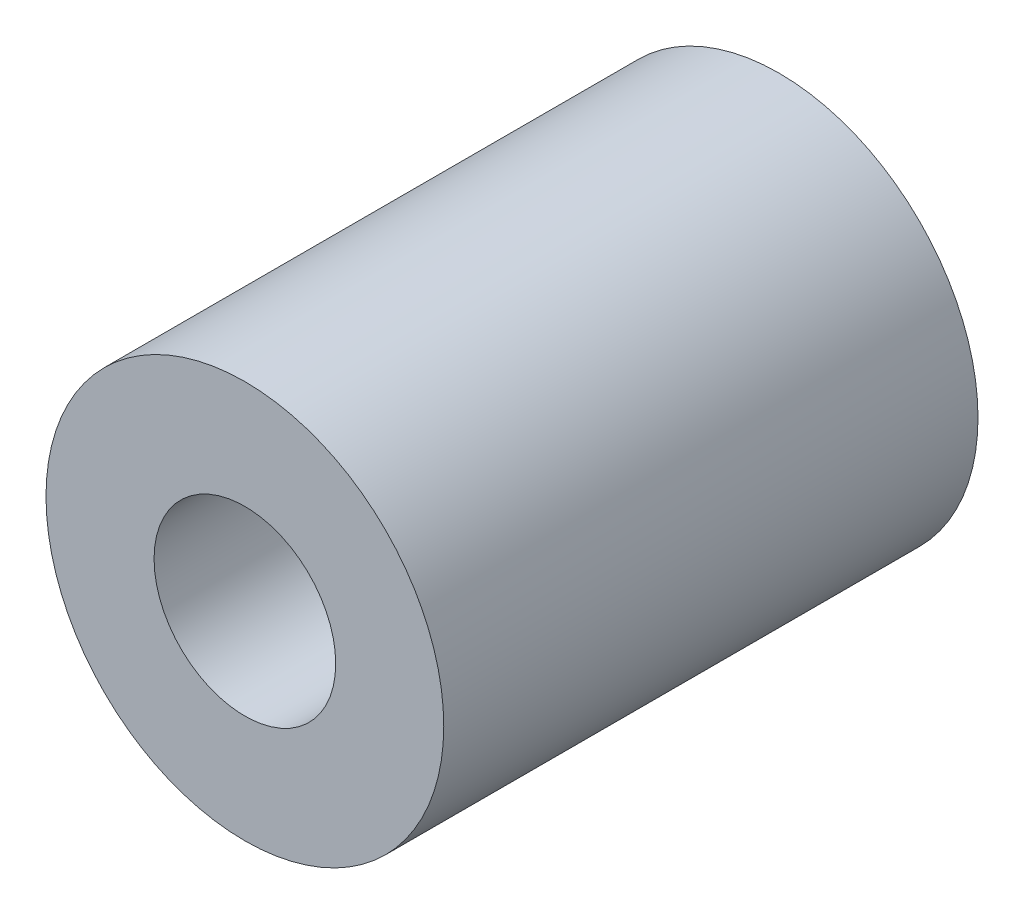
ISO-10303-21;
HEADER;
FILE_DESCRIPTION(('STEP AP214'),'2;1');
FILE_NAME('part.step','',(''),(''),'','','');
FILE_SCHEMA(('AUTOMOTIVE_DESIGN { 1 0 10303 214 1 1 1 1 }'));
ENDSEC;
DATA;
#1=APPLICATION_CONTEXT('core data for automotive mechanical design processes');
#2=APPLICATION_PROTOCOL_DEFINITION('international standard','automotive_design',2000,#1);
#3=PRODUCT_CONTEXT('',#1,'mechanical');
#4=PRODUCT('Part','Part','',(#3));
#5=PRODUCT_RELATED_PRODUCT_CATEGORY('part','',(#4));
#6=PRODUCT_DEFINITION_FORMATION('','',#4);
#7=PRODUCT_DEFINITION_CONTEXT('part definition',#1,'design');
#8=PRODUCT_DEFINITION('design','',#6,#7);
#9=PRODUCT_DEFINITION_SHAPE('','',#8);
#10=(LENGTH_UNIT() NAMED_UNIT(*) SI_UNIT(.MILLI.,.METRE.));
#11=(NAMED_UNIT(*) PLANE_ANGLE_UNIT() SI_UNIT($,.RADIAN.));
#12=(NAMED_UNIT(*) SI_UNIT($,.STERADIAN.) SOLID_ANGLE_UNIT());
#13=UNCERTAINTY_MEASURE_WITH_UNIT(LENGTH_MEASURE(1.E-05),#10,'distance_accuracy_value','');
#14=(GEOMETRIC_REPRESENTATION_CONTEXT(3) GLOBAL_UNCERTAINTY_ASSIGNED_CONTEXT((#13)) GLOBAL_UNIT_ASSIGNED_CONTEXT((#10,
#11,#12)) REPRESENTATION_CONTEXT('',''));
#15=CARTESIAN_POINT('',(0.,0.,0.));
#16=DIRECTION('',(0.,0.,1.));
#17=DIRECTION('',(1.,0.,0.));
#18=AXIS2_PLACEMENT_3D('',#15,#16,#17);
#19=CARTESIAN_POINT('',(-60.5331278182863,-24.4695335879027,15.));
#20=DIRECTION('',(0.,0.,-1.));
#21=DIRECTION('',(-1.,0.,0.));
#22=AXIS2_PLACEMENT_3D('',#19,#20,#21);
#23=CYLINDRICAL_SURFACE('',#22,5.58400014439683);
#24=CARTESIAN_POINT('',(-60.5331278182863,-24.4695335879027,15.));
#25=DIRECTION('',(0.,0.,1.));
#26=DIRECTION('',(1.,0.,0.));
#27=AXIS2_PLACEMENT_3D('',#24,#25,#26);
#28=CIRCLE('',#27,5.58400014439683);
#29=CARTESIAN_POINT('',(-54.9491276738895,-24.4695335879027,15.));
#30=VERTEX_POINT('',#29);
#31=EDGE_CURVE('E10',#30,#30,#28,.T.);
#32=ORIENTED_EDGE('',*,*,#31,.F.);
#33=EDGE_LOOP('',(#32));
#34=FACE_BOUND('',#33,.T.);
#35=CARTESIAN_POINT('',(-60.5331278182863,-24.4695335879027,0.));
#36=DIRECTION('',(0.,0.,1.));
#37=DIRECTION('',(1.,0.,0.));
#38=AXIS2_PLACEMENT_3D('',#35,#36,#37);
#39=CIRCLE('',#38,5.58400014439683);
#40=CARTESIAN_POINT('',(-54.9491276738895,-24.4695335879027,0.));
#41=VERTEX_POINT('',#40);
#42=EDGE_CURVE('E38',#41,#41,#39,.T.);
#43=ORIENTED_EDGE('',*,*,#42,.T.);
#44=EDGE_LOOP('',(#43));
#45=FACE_BOUND('',#44,.T.);
#46=ADVANCED_FACE('F31',(#34,#45),#23,.T.);
#47=CARTESIAN_POINT('',(-60.5331278182863,-24.4695335879027,15.));
#48=DIRECTION('',(0.,0.,1.));
#49=DIRECTION('',(1.,0.,0.));
#50=AXIS2_PLACEMENT_3D('',#47,#48,#49);
#51=PLANE('',#50);
#52=CARTESIAN_POINT('',(-60.5331278182867,-24.4695335879029,15.));
#53=DIRECTION('',(0.,0.,1.));
#54=DIRECTION('',(1.,0.,0.));
#55=AXIS2_PLACEMENT_3D('',#52,#53,#54);
#56=CIRCLE('',#55,2.55);
#57=CARTESIAN_POINT('',(-57.9831278182867,-24.4695335879029,15.));
#58=VERTEX_POINT('',#57);
#59=EDGE_CURVE('E50',#58,#58,#56,.T.);
#60=ORIENTED_EDGE('',*,*,#59,.F.);
#61=EDGE_LOOP('',(#60));
#62=FACE_BOUND('',#61,.T.);
#63=ORIENTED_EDGE('',*,*,#31,.T.);
#64=EDGE_LOOP('',(#63));
#65=FACE_BOUND('',#64,.T.);
#66=ADVANCED_FACE('F74',(#62,#65),#51,.T.);
#67=CARTESIAN_POINT('',(-60.5331278182863,-24.4695335879027,0.));
#68=DIRECTION('',(0.,0.,1.));
#69=DIRECTION('',(1.,0.,0.));
#70=AXIS2_PLACEMENT_3D('',#67,#68,#69);
#71=PLANE('',#70);
#72=CARTESIAN_POINT('',(-60.5331278182863,-24.4695335879027,0.));
#73=DIRECTION('',(0.,0.,-1.));
#74=DIRECTION('',(-1.,0.,0.));
#75=AXIS2_PLACEMENT_3D('',#72,#73,#74);
#76=CIRCLE('',#75,2.6);
#77=CARTESIAN_POINT('',(-63.1331278182863,-24.4695335879027,0.));
#78=VERTEX_POINT('',#77);
#79=EDGE_CURVE('E45',#78,#78,#76,.T.);
#80=ORIENTED_EDGE('',*,*,#79,.F.);
#81=EDGE_LOOP('',(#80));
#82=FACE_BOUND('',#81,.T.);
#83=ORIENTED_EDGE('',*,*,#42,.F.);
#84=EDGE_LOOP('',(#83));
#85=FACE_BOUND('',#84,.T.);
#86=ADVANCED_FACE('F68',(#82,#85),#71,.F.);
#87=CARTESIAN_POINT('',(-60.5331278182863,-24.4695335879027,8.2));
#88=DIRECTION('',(0.,0.,-1.));
#89=DIRECTION('',(-1.,0.,0.));
#90=AXIS2_PLACEMENT_3D('',#87,#88,#89);
#91=CYLINDRICAL_SURFACE('',#90,2.6);
#92=CARTESIAN_POINT('',(-60.5331278182863,-24.4695335879027,8.2));
#93=DIRECTION('',(0.,0.,-1.));
#94=DIRECTION('',(-1.,0.,0.));
#95=AXIS2_PLACEMENT_3D('',#92,#93,#94);
#96=CIRCLE('',#95,2.6);
#97=CARTESIAN_POINT('',(-63.1331278182863,-24.4695335879027,8.2));
#98=VERTEX_POINT('',#97);
#99=EDGE_CURVE('E43',#98,#98,#96,.T.);
#100=ORIENTED_EDGE('',*,*,#99,.F.);
#101=EDGE_LOOP('',(#100));
#102=FACE_BOUND('',#101,.T.);
#103=ORIENTED_EDGE('',*,*,#79,.T.);
#104=EDGE_LOOP('',(#103));
#105=FACE_BOUND('',#104,.T.);
#106=ADVANCED_FACE('F62',(#102,#105),#91,.F.);
#107=CARTESIAN_POINT('',(-60.5331278182863,-24.4695335879027,8.2));
#108=DIRECTION('',(0.,0.,-1.));
#109=DIRECTION('',(-1.,0.,0.));
#110=AXIS2_PLACEMENT_3D('',#107,#108,#109);
#111=PLANE('',#110);
#112=CARTESIAN_POINT('',(-60.5331278182867,-24.4695335879029,8.2));
#113=DIRECTION('',(0.,0.,-1.));
#114=DIRECTION('',(-1.,0.,0.));
#115=AXIS2_PLACEMENT_3D('',#112,#113,#114);
#116=CIRCLE('',#115,2.55);
#117=CARTESIAN_POINT('',(-63.0831278182867,-24.4695335879029,8.2));
#118=VERTEX_POINT('',#117);
#119=EDGE_CURVE('E34',#118,#118,#116,.T.);
#120=ORIENTED_EDGE('',*,*,#119,.F.);
#121=EDGE_LOOP('',(#120));
#122=FACE_BOUND('',#121,.T.);
#123=ORIENTED_EDGE('',*,*,#99,.T.);
#124=EDGE_LOOP('',(#123));
#125=FACE_BOUND('',#124,.T.);
#126=ADVANCED_FACE('F59',(#122,#125),#111,.T.);
#127=CARTESIAN_POINT('',(-60.5331278182867,-24.4695335879029,8.));
#128=DIRECTION('',(0.,0.,1.));
#129=DIRECTION('',(1.,0.,0.));
#130=AXIS2_PLACEMENT_3D('',#127,#128,#129);
#131=CYLINDRICAL_SURFACE('',#130,2.55);
#132=ORIENTED_EDGE('',*,*,#119,.T.);
#133=EDGE_LOOP('',(#132));
#134=FACE_BOUND('',#133,.T.);
#135=ORIENTED_EDGE('',*,*,#59,.T.);
#136=EDGE_LOOP('',(#135));
#137=FACE_BOUND('',#136,.T.);
#138=ADVANCED_FACE('F57',(#134,#137),#131,.F.);
#139=CLOSED_SHELL('',(#46,#66,#86,#106,#126,#138));
#140=MANIFOLD_SOLID_BREP('B2',#139);
#141=ADVANCED_BREP_SHAPE_REPRESENTATION('',(#18,#140),#14);
#142=SHAPE_DEFINITION_REPRESENTATION(#9,#141);
ENDSEC;
END-ISO-10303-21;
